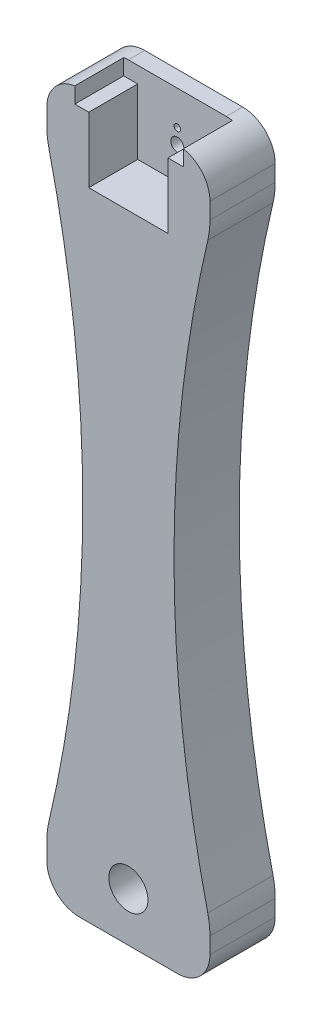
ISO-10303-21;
HEADER;
FILE_DESCRIPTION(('STEP AP214'),'2;1');
FILE_NAME('part.step','',(''),(''),'','','');
FILE_SCHEMA(('AUTOMOTIVE_DESIGN { 1 0 10303 214 1 1 1 1 }'));
ENDSEC;
DATA;
#1=APPLICATION_CONTEXT('core data for automotive mechanical design processes');
#2=APPLICATION_PROTOCOL_DEFINITION('international standard','automotive_design',2000,#1);
#3=PRODUCT_CONTEXT('',#1,'mechanical');
#4=PRODUCT('Part','Part','',(#3));
#5=PRODUCT_RELATED_PRODUCT_CATEGORY('part','',(#4));
#6=PRODUCT_DEFINITION_FORMATION('','',#4);
#7=PRODUCT_DEFINITION_CONTEXT('part definition',#1,'design');
#8=PRODUCT_DEFINITION('design','',#6,#7);
#9=PRODUCT_DEFINITION_SHAPE('','',#8);
#10=(LENGTH_UNIT() NAMED_UNIT(*) SI_UNIT(.MILLI.,.METRE.));
#11=(NAMED_UNIT(*) PLANE_ANGLE_UNIT() SI_UNIT($,.RADIAN.));
#12=(NAMED_UNIT(*) SI_UNIT($,.STERADIAN.) SOLID_ANGLE_UNIT());
#13=UNCERTAINTY_MEASURE_WITH_UNIT(LENGTH_MEASURE(1.E-05),#10,'distance_accuracy_value','');
#14=(GEOMETRIC_REPRESENTATION_CONTEXT(3) GLOBAL_UNCERTAINTY_ASSIGNED_CONTEXT((#13)) GLOBAL_UNIT_ASSIGNED_CONTEXT((#10,
#11,#12)) REPRESENTATION_CONTEXT('',''));
#15=CARTESIAN_POINT('',(0.,0.,0.));
#16=DIRECTION('',(0.,0.,1.));
#17=DIRECTION('',(1.,0.,0.));
#18=AXIS2_PLACEMENT_3D('',#15,#16,#17);
#19=CARTESIAN_POINT('',(0.,0.,20.));
#20=DIRECTION('',(0.,0.,1.));
#21=DIRECTION('',(1.,0.,0.));
#22=AXIS2_PLACEMENT_3D('',#19,#20,#21);
#23=PLANE('',#22);
#24=CARTESIAN_POINT('',(25.,-205.,20.));
#25=DIRECTION('',(0.,0.,1.));
#26=DIRECTION('',(1.,0.,0.));
#27=AXIS2_PLACEMENT_3D('',#24,#25,#26);
#28=CIRCLE('',#27,6.);
#29=CARTESIAN_POINT('',(31.,-205.,20.));
#30=VERTEX_POINT('',#29);
#31=EDGE_CURVE('E303',#30,#30,#28,.T.);
#32=ORIENTED_EDGE('',*,*,#31,.F.);
#33=EDGE_LOOP('',(#32));
#34=FACE_BOUND('',#33,.T.);
#35=CARTESIAN_POINT('',(428.980197534483,-110.,20.));
#36=DIRECTION('',(0.,0.,1.));
#37=DIRECTION('',(1.,0.,0.));
#38=AXIS2_PLACEMENT_3D('',#35,#36,#37);
#39=CIRCLE('',#38,390.);
#40=CARTESIAN_POINT('',(49.3361564779809,-20.7228915662651,20.));
#41=VERTEX_POINT('',#40);
#42=CARTESIAN_POINT('',(49.3361564779809,-199.277108433735,20.));
#43=VERTEX_POINT('',#42);
#44=EDGE_CURVE('E199',#41,#43,#39,.T.);
#45=ORIENTED_EDGE('',*,*,#44,.F.);
#46=CARTESIAN_POINT('',(25.,-15.,20.));
#47=DIRECTION('',(0.,0.,1.));
#48=DIRECTION('',(1.,0.,0.));
#49=AXIS2_PLACEMENT_3D('',#46,#47,#48);
#50=CIRCLE('',#49,25.);
#51=CARTESIAN_POINT('',(50.,-15.,20.));
#52=VERTEX_POINT('',#51);
#53=EDGE_CURVE('E208',#41,#52,#50,.T.);
#54=ORIENTED_EDGE('',*,*,#53,.T.);
#55=DIRECTION('',(0.,1.,0.));
#56=VECTOR('',#55,1.);
#57=CARTESIAN_POINT('',(50.,0.,20.));
#58=LINE('',#57,#56);
#59=CARTESIAN_POINT('',(50.,-10.,20.));
#60=VERTEX_POINT('',#59);
#61=EDGE_CURVE('E314',#52,#60,#58,.T.);
#62=ORIENTED_EDGE('',*,*,#61,.T.);
#63=CARTESIAN_POINT('',(40.,-10.,20.));
#64=DIRECTION('',(0.,0.,1.));
#65=DIRECTION('',(1.,0.,0.));
#66=AXIS2_PLACEMENT_3D('',#63,#64,#65);
#67=CIRCLE('',#66,10.);
#68=CARTESIAN_POINT('',(41.8579774574081,-0.174119898565656,20.));
#69=VERTEX_POINT('',#68);
#70=EDGE_CURVE('E361',#60,#69,#67,.T.);
#71=ORIENTED_EDGE('',*,*,#70,.T.);
#72=DIRECTION('',(0.,1.,0.));
#73=VECTOR('',#72,1.);
#74=CARTESIAN_POINT('',(41.8579774574081,0.,20.));
#75=LINE('',#74,#73);
#76=CARTESIAN_POINT('',(41.8579774574081,-4.95640450851839,20.));
#77=VERTEX_POINT('',#76);
#78=EDGE_CURVE('E246',#77,#69,#75,.T.);
#79=ORIENTED_EDGE('',*,*,#78,.F.);
#80=DIRECTION('',(1.,0.,0.));
#81=VECTOR('',#80,1.);
#82=CARTESIAN_POINT('',(0.,-4.95640450851839,20.));
#83=LINE('',#82,#81);
#84=CARTESIAN_POINT('',(37.14,-4.95640450851839,20.));
#85=VERTEX_POINT('',#84);
#86=EDGE_CURVE('E255',#85,#77,#83,.T.);
#87=ORIENTED_EDGE('',*,*,#86,.F.);
#88=DIRECTION('',(0.,1.,0.));
#89=VECTOR('',#88,1.);
#90=CARTESIAN_POINT('',(37.14,0.,20.));
#91=LINE('',#90,#89);
#92=CARTESIAN_POINT('',(37.14,-25.,20.));
#93=VERTEX_POINT('',#92);
#94=EDGE_CURVE('E290',#93,#85,#91,.T.);
#95=ORIENTED_EDGE('',*,*,#94,.F.);
#96=DIRECTION('',(1.,0.,0.));
#97=VECTOR('',#96,1.);
#98=CARTESIAN_POINT('',(25.,-25.,20.));
#99=LINE('',#98,#97);
#100=CARTESIAN_POINT('',(12.86,-25.,20.));
#101=VERTEX_POINT('',#100);
#102=EDGE_CURVE('E283',#101,#93,#99,.T.);
#103=ORIENTED_EDGE('',*,*,#102,.F.);
#104=DIRECTION('',(0.,-1.,0.));
#105=VECTOR('',#104,1.);
#106=CARTESIAN_POINT('',(12.86,-25.,20.));
#107=LINE('',#106,#105);
#108=CARTESIAN_POINT('',(12.86,-4.95640450851839,20.));
#109=VERTEX_POINT('',#108);
#110=EDGE_CURVE('E293',#109,#101,#107,.T.);
#111=ORIENTED_EDGE('',*,*,#110,.F.);
#112=CARTESIAN_POINT('',(8.5779774574081,-4.95640450851839,20.));
#113=VERTEX_POINT('',#112);
#114=EDGE_CURVE('E256',#113,#109,#83,.T.);
#115=ORIENTED_EDGE('',*,*,#114,.F.);
#116=DIRECTION('',(0.,1.,0.));
#117=VECTOR('',#116,1.);
#118=CARTESIAN_POINT('',(8.5779774574081,0.,20.));
#119=LINE('',#118,#117);
#120=CARTESIAN_POINT('',(8.5779774574081,-0.101623775165925,20.));
#121=VERTEX_POINT('',#120);
#122=EDGE_CURVE('E221',#113,#121,#119,.T.);
#123=ORIENTED_EDGE('',*,*,#122,.T.);
#124=CARTESIAN_POINT('',(10.,-10.,20.));
#125=DIRECTION('',(0.,0.,1.));
#126=DIRECTION('',(1.,0.,0.));
#127=AXIS2_PLACEMENT_3D('',#124,#125,#126);
#128=CIRCLE('',#127,10.);
#129=CARTESIAN_POINT('',(0.,-10.,20.));
#130=VERTEX_POINT('',#129);
#131=EDGE_CURVE('E364',#121,#130,#128,.T.);
#132=ORIENTED_EDGE('',*,*,#131,.T.);
#133=DIRECTION('',(0.,-1.,0.));
#134=VECTOR('',#133,1.);
#135=CARTESIAN_POINT('',(0.,0.,20.));
#136=LINE('',#135,#134);
#137=CARTESIAN_POINT('',(0.,-14.9999999999815,20.));
#138=VERTEX_POINT('',#137);
#139=EDGE_CURVE('E307',#130,#138,#136,.T.);
#140=ORIENTED_EDGE('',*,*,#139,.T.);
#141=CARTESIAN_POINT('',(25.,-15.,20.));
#142=DIRECTION('',(0.,0.,1.));
#143=DIRECTION('',(1.,0.,0.));
#144=AXIS2_PLACEMENT_3D('',#141,#142,#143);
#145=CIRCLE('',#144,25.);
#146=CARTESIAN_POINT('',(0.663843522019123,-20.722891566265,20.));
#147=VERTEX_POINT('',#146);
#148=EDGE_CURVE('E226',#138,#147,#145,.T.);
#149=ORIENTED_EDGE('',*,*,#148,.T.);
#150=CARTESIAN_POINT('',(-378.980197534483,-110.,20.));
#151=DIRECTION('',(0.,0.,1.));
#152=DIRECTION('',(1.,0.,0.));
#153=AXIS2_PLACEMENT_3D('',#150,#151,#152);
#154=CIRCLE('',#153,390.);
#155=CARTESIAN_POINT('',(0.66384352201912,-199.277108433735,20.));
#156=VERTEX_POINT('',#155);
#157=EDGE_CURVE('E232',#156,#147,#154,.T.);
#158=ORIENTED_EDGE('',*,*,#157,.F.);
#159=CARTESIAN_POINT('',(25.,-205.,20.));
#160=DIRECTION('',(0.,0.,1.));
#161=DIRECTION('',(1.,0.,0.));
#162=AXIS2_PLACEMENT_3D('',#159,#160,#161);
#163=CIRCLE('',#162,25.);
#164=CARTESIAN_POINT('',(0.,-205.,20.));
#165=VERTEX_POINT('',#164);
#166=EDGE_CURVE('E229',#156,#165,#163,.T.);
#167=ORIENTED_EDGE('',*,*,#166,.T.);
#168=CARTESIAN_POINT('',(0.,-210.,20.));
#169=VERTEX_POINT('',#168);
#170=EDGE_CURVE('E311',#165,#169,#136,.T.);
#171=ORIENTED_EDGE('',*,*,#170,.T.);
#172=CARTESIAN_POINT('',(10.,-210.,20.));
#173=DIRECTION('',(0.,0.,1.));
#174=DIRECTION('',(1.,0.,0.));
#175=AXIS2_PLACEMENT_3D('',#172,#173,#174);
#176=CIRCLE('',#175,10.);
#177=CARTESIAN_POINT('',(10.,-220.,20.));
#178=VERTEX_POINT('',#177);
#179=EDGE_CURVE('E357',#169,#178,#176,.T.);
#180=ORIENTED_EDGE('',*,*,#179,.T.);
#181=DIRECTION('',(1.,0.,0.));
#182=VECTOR('',#181,1.);
#183=CARTESIAN_POINT('',(0.,-220.,20.));
#184=LINE('',#183,#182);
#185=CARTESIAN_POINT('',(40.,-220.,20.));
#186=VERTEX_POINT('',#185);
#187=EDGE_CURVE('E310',#178,#186,#184,.T.);
#188=ORIENTED_EDGE('',*,*,#187,.T.);
#189=CARTESIAN_POINT('',(40.,-210.,20.));
#190=DIRECTION('',(0.,0.,1.));
#191=DIRECTION('',(1.,0.,0.));
#192=AXIS2_PLACEMENT_3D('',#189,#190,#191);
#193=CIRCLE('',#192,10.);
#194=CARTESIAN_POINT('',(50.,-210.,20.));
#195=VERTEX_POINT('',#194);
#196=EDGE_CURVE('E359',#186,#195,#193,.T.);
#197=ORIENTED_EDGE('',*,*,#196,.T.);
#198=CARTESIAN_POINT('',(50.,-205.,20.));
#199=VERTEX_POINT('',#198);
#200=EDGE_CURVE('E315',#195,#199,#58,.T.);
#201=ORIENTED_EDGE('',*,*,#200,.T.);
#202=CARTESIAN_POINT('',(25.,-205.,20.));
#203=DIRECTION('',(0.,0.,1.));
#204=DIRECTION('',(1.,0.,0.));
#205=AXIS2_PLACEMENT_3D('',#202,#203,#204);
#206=CIRCLE('',#205,25.);
#207=EDGE_CURVE('E205',#199,#43,#206,.T.);
#208=ORIENTED_EDGE('',*,*,#207,.T.);
#209=EDGE_LOOP('',(#45,#54,#62,#71,#79,#87,#95,#103,#111,#115,#123,#132,#140,#149,#158,#167,
#171,#180,#188,#197,#201,#208));
#210=FACE_BOUND('',#209,.T.);
#211=ADVANCED_FACE('F37',(#34,#210),#23,.T.);
#212=CARTESIAN_POINT('',(0.,0.,20.));
#213=DIRECTION('',(1.,0.,0.));
#214=DIRECTION('',(0.,1.,0.));
#215=AXIS2_PLACEMENT_3D('',#212,#213,#214);
#216=PLANE('',#215);
#217=DIRECTION('',(0.,0.,1.));
#218=VECTOR('',#217,1.);
#219=CARTESIAN_POINT('',(0.,-205.,-33.));
#220=LINE('',#219,#218);
#221=CARTESIAN_POINT('',(0.,-205.,0.));
#222=VERTEX_POINT('',#221);
#223=EDGE_CURVE('E238',#222,#165,#220,.T.);
#224=ORIENTED_EDGE('',*,*,#223,.F.);
#225=DIRECTION('',(0.,-1.,0.));
#226=VECTOR('',#225,1.);
#227=CARTESIAN_POINT('',(0.,0.,0.));
#228=LINE('',#227,#226);
#229=CARTESIAN_POINT('',(0.,-210.,0.));
#230=VERTEX_POINT('',#229);
#231=EDGE_CURVE('E322',#222,#230,#228,.T.);
#232=ORIENTED_EDGE('',*,*,#231,.T.);
#233=DIRECTION('',(0.,0.,-1.));
#234=VECTOR('',#233,1.);
#235=CARTESIAN_POINT('',(0.,-210.,20.));
#236=LINE('',#235,#234);
#237=EDGE_CURVE('E317',#230,#169,#236,.F.);
#238=ORIENTED_EDGE('',*,*,#237,.T.);
#239=ORIENTED_EDGE('',*,*,#170,.F.);
#240=EDGE_LOOP('',(#224,#232,#238,#239));
#241=FACE_BOUND('',#240,.T.);
#242=ADVANCED_FACE('F470',(#241),#216,.F.);
#243=CARTESIAN_POINT('',(50.,0.,20.));
#244=DIRECTION('',(-1.,0.,0.));
#245=DIRECTION('',(0.,-1.,0.));
#246=AXIS2_PLACEMENT_3D('',#243,#244,#245);
#247=PLANE('',#246);
#248=DIRECTION('',(0.,0.,1.));
#249=VECTOR('',#248,1.);
#250=CARTESIAN_POINT('',(50.,-15.,-33.));
#251=LINE('',#250,#249);
#252=CARTESIAN_POINT('',(50.,-15.,0.));
#253=VERTEX_POINT('',#252);
#254=EDGE_CURVE('E211',#253,#52,#251,.T.);
#255=ORIENTED_EDGE('',*,*,#254,.F.);
#256=DIRECTION('',(0.,1.,0.));
#257=VECTOR('',#256,1.);
#258=CARTESIAN_POINT('',(50.,0.,0.));
#259=LINE('',#258,#257);
#260=CARTESIAN_POINT('',(50.,-10.,0.));
#261=VERTEX_POINT('',#260);
#262=EDGE_CURVE('E325',#253,#261,#259,.T.);
#263=ORIENTED_EDGE('',*,*,#262,.T.);
#264=DIRECTION('',(0.,0.,-1.));
#265=VECTOR('',#264,1.);
#266=CARTESIAN_POINT('',(50.,-10.,20.));
#267=LINE('',#266,#265);
#268=EDGE_CURVE('E369',#261,#60,#267,.F.);
#269=ORIENTED_EDGE('',*,*,#268,.T.);
#270=ORIENTED_EDGE('',*,*,#61,.F.);
#271=EDGE_LOOP('',(#255,#263,#269,#270));
#272=FACE_BOUND('',#271,.T.);
#273=ADVANCED_FACE('F406',(#272),#247,.F.);
#274=CARTESIAN_POINT('',(0.,0.,0.));
#275=DIRECTION('',(0.,0.,1.));
#276=DIRECTION('',(1.,0.,0.));
#277=AXIS2_PLACEMENT_3D('',#274,#275,#276);
#278=PLANE('',#277);
#279=CARTESIAN_POINT('',(25.,-10.5,0.));
#280=DIRECTION('',(0.,0.,-1.));
#281=DIRECTION('',(-1.,0.,0.));
#282=AXIS2_PLACEMENT_3D('',#279,#280,#281);
#283=CIRCLE('',#282,1.);
#284=CARTESIAN_POINT('',(24.,-10.5,0.));
#285=VERTEX_POINT('',#284);
#286=EDGE_CURVE('E273',#285,#285,#283,.T.);
#287=ORIENTED_EDGE('',*,*,#286,.F.);
#288=EDGE_LOOP('',(#287));
#289=FACE_BOUND('',#288,.T.);
#290=CARTESIAN_POINT('',(25.,-19.5,0.));
#291=DIRECTION('',(0.,0.,-1.));
#292=DIRECTION('',(-1.,0.,0.));
#293=AXIS2_PLACEMENT_3D('',#290,#291,#292);
#294=CIRCLE('',#293,1.);
#295=CARTESIAN_POINT('',(24.,-19.5,0.));
#296=VERTEX_POINT('',#295);
#297=EDGE_CURVE('E272',#296,#296,#294,.T.);
#298=ORIENTED_EDGE('',*,*,#297,.F.);
#299=EDGE_LOOP('',(#298));
#300=FACE_BOUND('',#299,.T.);
#301=CARTESIAN_POINT('',(25.,-205.,0.));
#302=DIRECTION('',(0.,0.,1.));
#303=DIRECTION('',(1.,0.,0.));
#304=AXIS2_PLACEMENT_3D('',#301,#302,#303);
#305=CIRCLE('',#304,6.);
#306=CARTESIAN_POINT('',(31.,-205.,0.));
#307=VERTEX_POINT('',#306);
#308=EDGE_CURVE('E334',#307,#307,#305,.T.);
#309=ORIENTED_EDGE('',*,*,#308,.T.);
#310=EDGE_LOOP('',(#309));
#311=FACE_BOUND('',#310,.T.);
#312=CARTESIAN_POINT('',(25.,-15.,0.));
#313=DIRECTION('',(0.,0.,1.));
#314=DIRECTION('',(1.,0.,0.));
#315=AXIS2_PLACEMENT_3D('',#312,#313,#314);
#316=CIRCLE('',#315,2.);
#317=CARTESIAN_POINT('',(27.,-15.,0.));
#318=VERTEX_POINT('',#317);
#319=EDGE_CURVE('E306',#318,#318,#316,.T.);
#320=ORIENTED_EDGE('',*,*,#319,.T.);
#321=EDGE_LOOP('',(#320));
#322=FACE_BOUND('',#321,.T.);
#323=CARTESIAN_POINT('',(25.,-15.,0.));
#324=DIRECTION('',(0.,0.,1.));
#325=DIRECTION('',(1.,0.,0.));
#326=AXIS2_PLACEMENT_3D('',#323,#324,#325);
#327=CIRCLE('',#326,25.);
#328=CARTESIAN_POINT('',(49.3361564779809,-20.7228915662651,0.));
#329=VERTEX_POINT('',#328);
#330=EDGE_CURVE('E11',#329,#253,#327,.T.);
#331=ORIENTED_EDGE('',*,*,#330,.F.);
#332=CARTESIAN_POINT('',(428.980197534483,-110.,0.));
#333=DIRECTION('',(0.,0.,1.));
#334=DIRECTION('',(1.,0.,0.));
#335=AXIS2_PLACEMENT_3D('',#332,#333,#334);
#336=CIRCLE('',#335,390.);
#337=CARTESIAN_POINT('',(49.3361564779809,-199.277108433735,0.));
#338=VERTEX_POINT('',#337);
#339=EDGE_CURVE('E202',#329,#338,#336,.T.);
#340=ORIENTED_EDGE('',*,*,#339,.T.);
#341=CARTESIAN_POINT('',(25.,-205.,0.));
#342=DIRECTION('',(0.,0.,1.));
#343=DIRECTION('',(1.,0.,0.));
#344=AXIS2_PLACEMENT_3D('',#341,#342,#343);
#345=CIRCLE('',#344,25.);
#346=CARTESIAN_POINT('',(50.,-205.,0.));
#347=VERTEX_POINT('',#346);
#348=EDGE_CURVE('E45',#347,#338,#345,.T.);
#349=ORIENTED_EDGE('',*,*,#348,.F.);
#350=CARTESIAN_POINT('',(50.,-210.,0.));
#351=VERTEX_POINT('',#350);
#352=EDGE_CURVE('E326',#351,#347,#259,.T.);
#353=ORIENTED_EDGE('',*,*,#352,.F.);
#354=CARTESIAN_POINT('',(40.,-210.,0.));
#355=DIRECTION('',(0.,0.,1.));
#356=DIRECTION('',(1.,0.,0.));
#357=AXIS2_PLACEMENT_3D('',#354,#355,#356);
#358=CIRCLE('',#357,10.);
#359=CARTESIAN_POINT('',(40.,-220.,0.));
#360=VERTEX_POINT('',#359);
#361=EDGE_CURVE('E345',#351,#360,#358,.F.);
#362=ORIENTED_EDGE('',*,*,#361,.T.);
#363=DIRECTION('',(1.,0.,0.));
#364=VECTOR('',#363,1.);
#365=CARTESIAN_POINT('',(0.,-220.,0.));
#366=LINE('',#365,#364);
#367=CARTESIAN_POINT('',(10.,-220.,0.));
#368=VERTEX_POINT('',#367);
#369=EDGE_CURVE('E321',#368,#360,#366,.T.);
#370=ORIENTED_EDGE('',*,*,#369,.F.);
#371=CARTESIAN_POINT('',(10.,-210.,0.));
#372=DIRECTION('',(0.,0.,1.));
#373=DIRECTION('',(1.,0.,0.));
#374=AXIS2_PLACEMENT_3D('',#371,#372,#373);
#375=CIRCLE('',#374,10.);
#376=EDGE_CURVE('E342',#368,#230,#375,.F.);
#377=ORIENTED_EDGE('',*,*,#376,.T.);
#378=ORIENTED_EDGE('',*,*,#231,.F.);
#379=CARTESIAN_POINT('',(25.,-205.,0.));
#380=DIRECTION('',(0.,0.,1.));
#381=DIRECTION('',(1.,0.,0.));
#382=AXIS2_PLACEMENT_3D('',#379,#380,#381);
#383=CIRCLE('',#382,25.);
#384=CARTESIAN_POINT('',(0.66384352201912,-199.277108433735,0.));
#385=VERTEX_POINT('',#384);
#386=EDGE_CURVE('E391',#385,#222,#383,.T.);
#387=ORIENTED_EDGE('',*,*,#386,.F.);
#388=CARTESIAN_POINT('',(-378.980197534483,-110.,0.));
#389=DIRECTION('',(0.,0.,1.));
#390=DIRECTION('',(1.,0.,0.));
#391=AXIS2_PLACEMENT_3D('',#388,#389,#390);
#392=CIRCLE('',#391,390.);
#393=CARTESIAN_POINT('',(0.663843522019123,-20.722891566265,0.));
#394=VERTEX_POINT('',#393);
#395=EDGE_CURVE('E393',#385,#394,#392,.T.);
#396=ORIENTED_EDGE('',*,*,#395,.T.);
#397=CARTESIAN_POINT('',(25.,-15.,0.));
#398=DIRECTION('',(0.,0.,1.));
#399=DIRECTION('',(1.,0.,0.));
#400=AXIS2_PLACEMENT_3D('',#397,#398,#399);
#401=CIRCLE('',#400,25.);
#402=CARTESIAN_POINT('',(0.,-14.9999999999815,0.));
#403=VERTEX_POINT('',#402);
#404=EDGE_CURVE('E396',#403,#394,#401,.T.);
#405=ORIENTED_EDGE('',*,*,#404,.F.);
#406=CARTESIAN_POINT('',(0.,-10.,0.));
#407=VERTEX_POINT('',#406);
#408=EDGE_CURVE('E318',#407,#403,#228,.T.);
#409=ORIENTED_EDGE('',*,*,#408,.F.);
#410=CARTESIAN_POINT('',(10.,-10.,0.));
#411=DIRECTION('',(0.,0.,1.));
#412=DIRECTION('',(1.,0.,0.));
#413=AXIS2_PLACEMENT_3D('',#410,#411,#412);
#414=CIRCLE('',#413,10.);
#415=CARTESIAN_POINT('',(10.,0.,0.));
#416=VERTEX_POINT('',#415);
#417=EDGE_CURVE('E350',#407,#416,#414,.F.);
#418=ORIENTED_EDGE('',*,*,#417,.T.);
#419=DIRECTION('',(-1.,0.,0.));
#420=VECTOR('',#419,1.);
#421=CARTESIAN_POINT('',(0.,0.,0.));
#422=LINE('',#421,#420);
#423=CARTESIAN_POINT('',(40.,0.,0.));
#424=VERTEX_POINT('',#423);
#425=EDGE_CURVE('E329',#424,#416,#422,.T.);
#426=ORIENTED_EDGE('',*,*,#425,.F.);
#427=CARTESIAN_POINT('',(40.,-10.,0.));
#428=DIRECTION('',(0.,0.,1.));
#429=DIRECTION('',(1.,0.,0.));
#430=AXIS2_PLACEMENT_3D('',#427,#428,#429);
#431=CIRCLE('',#430,10.);
#432=EDGE_CURVE('E347',#424,#261,#431,.F.);
#433=ORIENTED_EDGE('',*,*,#432,.T.);
#434=ORIENTED_EDGE('',*,*,#262,.F.);
#435=EDGE_LOOP('',(#331,#340,#349,#353,#362,#370,#377,#378,#387,#396,#405,#409,#418,#426,#433,#434));
#436=FACE_BOUND('',#435,.T.);
#437=ADVANCED_FACE('F403',(#289,#300,#311,#322,#436),#278,.F.);
#438=CARTESIAN_POINT('',(0.,0.,20.));
#439=DIRECTION('',(0.,-1.,0.));
#440=DIRECTION('',(0.,0.,-1.));
#441=AXIS2_PLACEMENT_3D('',#438,#439,#440);
#442=PLANE('',#441);
#443=DIRECTION('',(-1.,0.,0.));
#444=VECTOR('',#443,1.);
#445=CARTESIAN_POINT('',(12.86,0.,5.));
#446=LINE('',#445,#444);
#447=CARTESIAN_POINT('',(40.,0.,5.));
#448=VERTEX_POINT('',#447);
#449=CARTESIAN_POINT('',(10.,0.,5.));
#450=VERTEX_POINT('',#449);
#451=EDGE_CURVE('E282',#448,#450,#446,.T.);
#452=ORIENTED_EDGE('',*,*,#451,.F.);
#453=DIRECTION('',(0.,0.,-1.));
#454=VECTOR('',#453,1.);
#455=CARTESIAN_POINT('',(40.,0.,20.));
#456=LINE('',#455,#454);
#457=EDGE_CURVE('E352',#448,#424,#456,.T.);
#458=ORIENTED_EDGE('',*,*,#457,.T.);
#459=ORIENTED_EDGE('',*,*,#425,.T.);
#460=DIRECTION('',(0.,0.,-1.));
#461=VECTOR('',#460,1.);
#462=CARTESIAN_POINT('',(10.,0.,20.));
#463=LINE('',#462,#461);
#464=EDGE_CURVE('E354',#416,#450,#463,.F.);
#465=ORIENTED_EDGE('',*,*,#464,.T.);
#466=EDGE_LOOP('',(#452,#458,#459,#465));
#467=FACE_BOUND('',#466,.T.);
#468=ADVANCED_FACE('F513',(#467),#442,.F.);
#469=CARTESIAN_POINT('',(10.,-10.,20.));
#470=DIRECTION('',(0.,0.,-1.));
#471=DIRECTION('',(-1.,0.,0.));
#472=AXIS2_PLACEMENT_3D('',#469,#470,#471);
#473=CYLINDRICAL_SURFACE('',#472,10.);
#474=ORIENTED_EDGE('',*,*,#131,.F.);
#475=DIRECTION('',(0.,0.,-1.));
#476=VECTOR('',#475,1.);
#477=CARTESIAN_POINT('',(8.5779774574081,-0.101623775165925,20.));
#478=LINE('',#477,#476);
#479=CARTESIAN_POINT('',(8.5779774574081,-0.101623775165925,5.));
#480=VERTEX_POINT('',#479);
#481=EDGE_CURVE('E388',#121,#480,#478,.T.);
#482=ORIENTED_EDGE('',*,*,#481,.T.);
#483=CARTESIAN_POINT('',(10.,-10.,5.));
#484=DIRECTION('',(0.,0.,1.));
#485=DIRECTION('',(1.,0.,0.));
#486=AXIS2_PLACEMENT_3D('',#483,#484,#485);
#487=CIRCLE('',#486,10.);
#488=EDGE_CURVE('E262',#480,#450,#487,.F.);
#489=ORIENTED_EDGE('',*,*,#488,.T.);
#490=ORIENTED_EDGE('',*,*,#464,.F.);
#491=ORIENTED_EDGE('',*,*,#417,.F.);
#492=DIRECTION('',(0.,0.,-1.));
#493=VECTOR('',#492,1.);
#494=CARTESIAN_POINT('',(0.,-10.,20.));
#495=LINE('',#494,#493);
#496=EDGE_CURVE('E339',#130,#407,#495,.T.);
#497=ORIENTED_EDGE('',*,*,#496,.F.);
#498=EDGE_LOOP('',(#474,#482,#489,#490,#491,#497));
#499=FACE_BOUND('',#498,.T.);
#500=ADVANCED_FACE('F453',(#499),#473,.T.);
#501=CARTESIAN_POINT('',(25.,-15.,-14.));
#502=DIRECTION('',(0.,0.,1.));
#503=DIRECTION('',(1.,0.,0.));
#504=AXIS2_PLACEMENT_3D('',#501,#502,#503);
#505=CYLINDRICAL_SURFACE('',#504,2.);
#506=ORIENTED_EDGE('',*,*,#319,.F.);
#507=EDGE_LOOP('',(#506));
#508=FACE_BOUND('',#507,.T.);
#509=CARTESIAN_POINT('',(25.,-15.,5.));
#510=DIRECTION('',(0.,0.,1.));
#511=DIRECTION('',(1.,0.,0.));
#512=AXIS2_PLACEMENT_3D('',#509,#510,#511);
#513=CIRCLE('',#512,2.);
#514=CARTESIAN_POINT('',(27.,-15.,5.));
#515=VERTEX_POINT('',#514);
#516=EDGE_CURVE('E300',#515,#515,#513,.F.);
#517=ORIENTED_EDGE('',*,*,#516,.F.);
#518=EDGE_LOOP('',(#517));
#519=FACE_BOUND('',#518,.T.);
#520=ADVANCED_FACE('F509',(#508,#519),#505,.F.);
#521=ORIENTED_EDGE('',*,*,#408,.T.);
#522=DIRECTION('',(0.,0.,1.));
#523=VECTOR('',#522,1.);
#524=CARTESIAN_POINT('',(0.,-14.9999999999815,-33.));
#525=LINE('',#524,#523);
#526=EDGE_CURVE('E235',#403,#138,#525,.T.);
#527=ORIENTED_EDGE('',*,*,#526,.T.);
#528=ORIENTED_EDGE('',*,*,#139,.F.);
#529=ORIENTED_EDGE('',*,*,#496,.T.);
#530=EDGE_LOOP('',(#521,#527,#528,#529));
#531=FACE_BOUND('',#530,.T.);
#532=ADVANCED_FACE('F457',(#531),#216,.F.);
#533=CARTESIAN_POINT('',(0.,-220.,20.));
#534=DIRECTION('',(0.,1.,0.));
#535=DIRECTION('',(0.,0.,1.));
#536=AXIS2_PLACEMENT_3D('',#533,#534,#535);
#537=PLANE('',#536);
#538=ORIENTED_EDGE('',*,*,#369,.T.);
#539=DIRECTION('',(0.,0.,-1.));
#540=VECTOR('',#539,1.);
#541=CARTESIAN_POINT('',(40.,-220.,20.));
#542=LINE('',#541,#540);
#543=EDGE_CURVE('E375',#360,#186,#542,.F.);
#544=ORIENTED_EDGE('',*,*,#543,.T.);
#545=ORIENTED_EDGE('',*,*,#187,.F.);
#546=DIRECTION('',(0.,0.,-1.));
#547=VECTOR('',#546,1.);
#548=CARTESIAN_POINT('',(10.,-220.,20.));
#549=LINE('',#548,#547);
#550=EDGE_CURVE('E372',#178,#368,#549,.T.);
#551=ORIENTED_EDGE('',*,*,#550,.T.);
#552=EDGE_LOOP('',(#538,#544,#545,#551));
#553=FACE_BOUND('',#552,.T.);
#554=ADVANCED_FACE('F479',(#553),#537,.F.);
#555=ORIENTED_EDGE('',*,*,#352,.T.);
#556=DIRECTION('',(0.,0.,1.));
#557=VECTOR('',#556,1.);
#558=CARTESIAN_POINT('',(50.,-205.,-33.));
#559=LINE('',#558,#557);
#560=EDGE_CURVE('E222',#347,#199,#559,.T.);
#561=ORIENTED_EDGE('',*,*,#560,.T.);
#562=ORIENTED_EDGE('',*,*,#200,.F.);
#563=DIRECTION('',(0.,0.,-1.));
#564=VECTOR('',#563,1.);
#565=CARTESIAN_POINT('',(50.,-210.,20.));
#566=LINE('',#565,#564);
#567=EDGE_CURVE('E366',#195,#351,#566,.T.);
#568=ORIENTED_EDGE('',*,*,#567,.T.);
#569=EDGE_LOOP('',(#555,#561,#562,#568));
#570=FACE_BOUND('',#569,.T.);
#571=ADVANCED_FACE('F487',(#570),#247,.F.);
#572=CARTESIAN_POINT('',(25.,-205.,-14.));
#573=DIRECTION('',(0.,0.,1.));
#574=DIRECTION('',(1.,0.,0.));
#575=AXIS2_PLACEMENT_3D('',#572,#573,#574);
#576=CYLINDRICAL_SURFACE('',#575,6.);
#577=ORIENTED_EDGE('',*,*,#31,.T.);
#578=EDGE_LOOP('',(#577));
#579=FACE_BOUND('',#578,.T.);
#580=ORIENTED_EDGE('',*,*,#308,.F.);
#581=EDGE_LOOP('',(#580));
#582=FACE_BOUND('',#581,.T.);
#583=ADVANCED_FACE('F520',(#579,#582),#576,.F.);
#584=CARTESIAN_POINT('',(40.,-10.,20.));
#585=DIRECTION('',(0.,0.,-1.));
#586=DIRECTION('',(-1.,0.,0.));
#587=AXIS2_PLACEMENT_3D('',#584,#585,#586);
#588=CYLINDRICAL_SURFACE('',#587,10.);
#589=DIRECTION('',(0.,0.,-1.));
#590=VECTOR('',#589,1.);
#591=CARTESIAN_POINT('',(41.8579774574081,-0.174119898565656,20.));
#592=LINE('',#591,#590);
#593=CARTESIAN_POINT('',(41.8579774574081,-0.174119898565656,5.));
#594=VERTEX_POINT('',#593);
#595=EDGE_CURVE('E386',#69,#594,#592,.T.);
#596=ORIENTED_EDGE('',*,*,#595,.F.);
#597=ORIENTED_EDGE('',*,*,#70,.F.);
#598=ORIENTED_EDGE('',*,*,#268,.F.);
#599=ORIENTED_EDGE('',*,*,#432,.F.);
#600=ORIENTED_EDGE('',*,*,#457,.F.);
#601=CARTESIAN_POINT('',(40.,-10.,5.));
#602=DIRECTION('',(0.,0.,1.));
#603=DIRECTION('',(1.,0.,0.));
#604=AXIS2_PLACEMENT_3D('',#601,#602,#603);
#605=CIRCLE('',#604,10.);
#606=EDGE_CURVE('E266',#448,#594,#605,.F.);
#607=ORIENTED_EDGE('',*,*,#606,.T.);
#608=EDGE_LOOP('',(#596,#597,#598,#599,#600,#607));
#609=FACE_BOUND('',#608,.T.);
#610=ADVANCED_FACE('F413',(#609),#588,.T.);
#611=CARTESIAN_POINT('',(40.,-210.,20.));
#612=DIRECTION('',(0.,0.,-1.));
#613=DIRECTION('',(-1.,0.,0.));
#614=AXIS2_PLACEMENT_3D('',#611,#612,#613);
#615=CYLINDRICAL_SURFACE('',#614,10.);
#616=ORIENTED_EDGE('',*,*,#196,.F.);
#617=ORIENTED_EDGE('',*,*,#543,.F.);
#618=ORIENTED_EDGE('',*,*,#361,.F.);
#619=ORIENTED_EDGE('',*,*,#567,.F.);
#620=EDGE_LOOP('',(#616,#617,#618,#619));
#621=FACE_BOUND('',#620,.T.);
#622=ADVANCED_FACE('F483',(#621),#615,.T.);
#623=CARTESIAN_POINT('',(10.,-210.,20.));
#624=DIRECTION('',(0.,0.,-1.));
#625=DIRECTION('',(-1.,0.,0.));
#626=AXIS2_PLACEMENT_3D('',#623,#624,#625);
#627=CYLINDRICAL_SURFACE('',#626,10.);
#628=ORIENTED_EDGE('',*,*,#179,.F.);
#629=ORIENTED_EDGE('',*,*,#237,.F.);
#630=ORIENTED_EDGE('',*,*,#376,.F.);
#631=ORIENTED_EDGE('',*,*,#550,.F.);
#632=EDGE_LOOP('',(#628,#629,#630,#631));
#633=FACE_BOUND('',#632,.T.);
#634=ADVANCED_FACE('F39',(#633),#627,.T.);
#635=CARTESIAN_POINT('',(0.,0.,5.));
#636=DIRECTION('',(0.,0.,1.));
#637=DIRECTION('',(1.,0.,0.));
#638=AXIS2_PLACEMENT_3D('',#635,#636,#637);
#639=PLANE('',#638);
#640=DIRECTION('',(0.,1.,0.));
#641=VECTOR('',#640,1.);
#642=CARTESIAN_POINT('',(37.14,0.,5.));
#643=LINE('',#642,#641);
#644=CARTESIAN_POINT('',(37.14,-25.,5.));
#645=VERTEX_POINT('',#644);
#646=CARTESIAN_POINT('',(37.14,-4.95640450851839,5.));
#647=VERTEX_POINT('',#646);
#648=EDGE_CURVE('E279',#645,#647,#643,.T.);
#649=ORIENTED_EDGE('',*,*,#648,.T.);
#650=DIRECTION('',(1.,0.,0.));
#651=VECTOR('',#650,1.);
#652=CARTESIAN_POINT('',(0.,-4.95640450851839,5.));
#653=LINE('',#652,#651);
#654=CARTESIAN_POINT('',(41.8579774574081,-4.95640450851839,5.));
#655=VERTEX_POINT('',#654);
#656=EDGE_CURVE('E245',#647,#655,#653,.T.);
#657=ORIENTED_EDGE('',*,*,#656,.T.);
#658=DIRECTION('',(0.,1.,0.));
#659=VECTOR('',#658,1.);
#660=CARTESIAN_POINT('',(41.8579774574081,0.,5.));
#661=LINE('',#660,#659);
#662=EDGE_CURVE('E249',#655,#594,#661,.T.);
#663=ORIENTED_EDGE('',*,*,#662,.T.);
#664=ORIENTED_EDGE('',*,*,#606,.F.);
#665=ORIENTED_EDGE('',*,*,#451,.T.);
#666=ORIENTED_EDGE('',*,*,#488,.F.);
#667=DIRECTION('',(0.,1.,0.));
#668=VECTOR('',#667,1.);
#669=CARTESIAN_POINT('',(8.5779774574081,0.,5.));
#670=LINE('',#669,#668);
#671=CARTESIAN_POINT('',(8.5779774574081,-4.95640450851839,5.));
#672=VERTEX_POINT('',#671);
#673=EDGE_CURVE('E242',#672,#480,#670,.T.);
#674=ORIENTED_EDGE('',*,*,#673,.F.);
#675=CARTESIAN_POINT('',(12.86,-4.95640450851839,5.));
#676=VERTEX_POINT('',#675);
#677=EDGE_CURVE('E247',#672,#676,#653,.T.);
#678=ORIENTED_EDGE('',*,*,#677,.T.);
#679=DIRECTION('',(0.,-1.,0.));
#680=VECTOR('',#679,1.);
#681=CARTESIAN_POINT('',(12.86,-25.,5.));
#682=LINE('',#681,#680);
#683=CARTESIAN_POINT('',(12.86,-25.,5.));
#684=VERTEX_POINT('',#683);
#685=EDGE_CURVE('E285',#676,#684,#682,.T.);
#686=ORIENTED_EDGE('',*,*,#685,.T.);
#687=DIRECTION('',(1.,0.,0.));
#688=VECTOR('',#687,1.);
#689=CARTESIAN_POINT('',(25.,-25.,5.));
#690=LINE('',#689,#688);
#691=EDGE_CURVE('E287',#684,#645,#690,.T.);
#692=ORIENTED_EDGE('',*,*,#691,.T.);
#693=EDGE_LOOP('',(#649,#657,#663,#664,#665,#666,#674,#678,#686,#692));
#694=FACE_BOUND('',#693,.T.);
#695=CARTESIAN_POINT('',(25.,-10.5,5.));
#696=DIRECTION('',(0.,0.,1.));
#697=DIRECTION('',(1.,0.,0.));
#698=AXIS2_PLACEMENT_3D('',#695,#696,#697);
#699=CIRCLE('',#698,1.);
#700=CARTESIAN_POINT('',(26.,-10.5,5.));
#701=VERTEX_POINT('',#700);
#702=EDGE_CURVE('E294',#701,#701,#699,.T.);
#703=ORIENTED_EDGE('',*,*,#702,.F.);
#704=EDGE_LOOP('',(#703));
#705=FACE_BOUND('',#704,.T.);
#706=CARTESIAN_POINT('',(25.,-19.5,5.));
#707=DIRECTION('',(0.,0.,1.));
#708=DIRECTION('',(1.,0.,0.));
#709=AXIS2_PLACEMENT_3D('',#706,#707,#708);
#710=CIRCLE('',#709,1.);
#711=CARTESIAN_POINT('',(26.,-19.5,5.));
#712=VERTEX_POINT('',#711);
#713=EDGE_CURVE('E276',#712,#712,#710,.T.);
#714=ORIENTED_EDGE('',*,*,#713,.F.);
#715=EDGE_LOOP('',(#714));
#716=FACE_BOUND('',#715,.T.);
#717=ORIENTED_EDGE('',*,*,#516,.T.);
#718=EDGE_LOOP('',(#717));
#719=FACE_BOUND('',#718,.T.);
#720=ADVANCED_FACE('F421',(#694,#705,#716,#719),#639,.T.);
#721=CARTESIAN_POINT('',(37.14,0.,5.));
#722=DIRECTION('',(1.,0.,0.));
#723=DIRECTION('',(0.,0.,-1.));
#724=AXIS2_PLACEMENT_3D('',#721,#722,#723);
#725=PLANE('',#724);
#726=ORIENTED_EDGE('',*,*,#94,.T.);
#727=DIRECTION('',(0.,0.,-1.));
#728=VECTOR('',#727,1.);
#729=CARTESIAN_POINT('',(37.14,-4.95640450851839,5.));
#730=LINE('',#729,#728);
#731=EDGE_CURVE('E269',#85,#647,#730,.T.);
#732=ORIENTED_EDGE('',*,*,#731,.T.);
#733=ORIENTED_EDGE('',*,*,#648,.F.);
#734=DIRECTION('',(0.,0.,1.));
#735=VECTOR('',#734,1.);
#736=CARTESIAN_POINT('',(37.14,-25.,5.));
#737=LINE('',#736,#735);
#738=EDGE_CURVE('E298',#645,#93,#737,.T.);
#739=ORIENTED_EDGE('',*,*,#738,.T.);
#740=EDGE_LOOP('',(#726,#732,#733,#739));
#741=FACE_BOUND('',#740,.T.);
#742=ADVANCED_FACE('F430',(#741),#725,.F.);
#743=CARTESIAN_POINT('',(25.,-25.,5.));
#744=DIRECTION('',(0.,-1.,0.));
#745=DIRECTION('',(0.,0.,-1.));
#746=AXIS2_PLACEMENT_3D('',#743,#744,#745);
#747=PLANE('',#746);
#748=ORIENTED_EDGE('',*,*,#102,.T.);
#749=ORIENTED_EDGE('',*,*,#738,.F.);
#750=ORIENTED_EDGE('',*,*,#691,.F.);
#751=DIRECTION('',(0.,0.,1.));
#752=VECTOR('',#751,1.);
#753=CARTESIAN_POINT('',(12.86,-25.,5.));
#754=LINE('',#753,#752);
#755=EDGE_CURVE('E289',#684,#101,#754,.T.);
#756=ORIENTED_EDGE('',*,*,#755,.T.);
#757=EDGE_LOOP('',(#748,#749,#750,#756));
#758=FACE_BOUND('',#757,.T.);
#759=ADVANCED_FACE('F434',(#758),#747,.F.);
#760=CARTESIAN_POINT('',(12.86,-25.,5.));
#761=DIRECTION('',(-1.,0.,0.));
#762=DIRECTION('',(0.,-1.,0.));
#763=AXIS2_PLACEMENT_3D('',#760,#761,#762);
#764=PLANE('',#763);
#765=ORIENTED_EDGE('',*,*,#685,.F.);
#766=DIRECTION('',(0.,0.,1.));
#767=VECTOR('',#766,1.);
#768=CARTESIAN_POINT('',(12.86,-4.95640450851839,5.));
#769=LINE('',#768,#767);
#770=EDGE_CURVE('E377',#676,#109,#769,.T.);
#771=ORIENTED_EDGE('',*,*,#770,.T.);
#772=ORIENTED_EDGE('',*,*,#110,.T.);
#773=ORIENTED_EDGE('',*,*,#755,.F.);
#774=EDGE_LOOP('',(#765,#771,#772,#773));
#775=FACE_BOUND('',#774,.T.);
#776=ADVANCED_FACE('F440',(#775),#764,.F.);
#777=CARTESIAN_POINT('',(25.,-19.5,15.));
#778=DIRECTION('',(0.,0.,-1.));
#779=DIRECTION('',(-1.,0.,0.));
#780=AXIS2_PLACEMENT_3D('',#777,#778,#779);
#781=CYLINDRICAL_SURFACE('',#780,1.);
#782=ORIENTED_EDGE('',*,*,#713,.T.);
#783=EDGE_LOOP('',(#782));
#784=FACE_BOUND('',#783,.T.);
#785=ORIENTED_EDGE('',*,*,#297,.T.);
#786=EDGE_LOOP('',(#785));
#787=FACE_BOUND('',#786,.T.);
#788=ADVANCED_FACE('F545',(#784,#787),#781,.F.);
#789=CARTESIAN_POINT('',(25.,-10.5,15.));
#790=DIRECTION('',(0.,0.,-1.));
#791=DIRECTION('',(-1.,0.,0.));
#792=AXIS2_PLACEMENT_3D('',#789,#790,#791);
#793=CYLINDRICAL_SURFACE('',#792,1.);
#794=ORIENTED_EDGE('',*,*,#702,.T.);
#795=EDGE_LOOP('',(#794));
#796=FACE_BOUND('',#795,.T.);
#797=ORIENTED_EDGE('',*,*,#286,.T.);
#798=EDGE_LOOP('',(#797));
#799=FACE_BOUND('',#798,.T.);
#800=ADVANCED_FACE('F693',(#796,#799),#793,.F.);
#801=CARTESIAN_POINT('',(0.,-4.95640450851839,5.));
#802=DIRECTION('',(0.,-1.,0.));
#803=DIRECTION('',(1.,0.,0.));
#804=AXIS2_PLACEMENT_3D('',#801,#802,#803);
#805=PLANE('',#804);
#806=ORIENTED_EDGE('',*,*,#677,.F.);
#807=DIRECTION('',(0.,0.,1.));
#808=VECTOR('',#807,1.);
#809=CARTESIAN_POINT('',(8.5779774574081,-4.95640450851839,5.));
#810=LINE('',#809,#808);
#811=EDGE_CURVE('E252',#672,#113,#810,.T.);
#812=ORIENTED_EDGE('',*,*,#811,.T.);
#813=ORIENTED_EDGE('',*,*,#114,.T.);
#814=ORIENTED_EDGE('',*,*,#770,.F.);
#815=EDGE_LOOP('',(#806,#812,#813,#814));
#816=FACE_BOUND('',#815,.T.);
#817=ADVANCED_FACE('F444',(#816),#805,.F.);
#818=CARTESIAN_POINT('',(8.5779774574081,0.,5.));
#819=DIRECTION('',(1.,0.,0.));
#820=DIRECTION('',(0.,0.,-1.));
#821=AXIS2_PLACEMENT_3D('',#818,#819,#820);
#822=PLANE('',#821);
#823=ORIENTED_EDGE('',*,*,#122,.F.);
#824=ORIENTED_EDGE('',*,*,#811,.F.);
#825=ORIENTED_EDGE('',*,*,#673,.T.);
#826=ORIENTED_EDGE('',*,*,#481,.F.);
#827=EDGE_LOOP('',(#823,#824,#825,#826));
#828=FACE_BOUND('',#827,.T.);
#829=ADVANCED_FACE('F448',(#828),#822,.T.);
#830=ORIENTED_EDGE('',*,*,#86,.T.);
#831=DIRECTION('',(0.,0.,1.));
#832=VECTOR('',#831,1.);
#833=CARTESIAN_POINT('',(41.8579774574081,-4.95640450851839,5.));
#834=LINE('',#833,#832);
#835=EDGE_CURVE('E259',#655,#77,#834,.T.);
#836=ORIENTED_EDGE('',*,*,#835,.F.);
#837=ORIENTED_EDGE('',*,*,#656,.F.);
#838=ORIENTED_EDGE('',*,*,#731,.F.);
#839=EDGE_LOOP('',(#830,#836,#837,#838));
#840=FACE_BOUND('',#839,.T.);
#841=ADVANCED_FACE('F426',(#840),#805,.F.);
#842=CARTESIAN_POINT('',(41.8579774574081,0.,5.));
#843=DIRECTION('',(1.,0.,0.));
#844=DIRECTION('',(0.,0.,-1.));
#845=AXIS2_PLACEMENT_3D('',#842,#843,#844);
#846=PLANE('',#845);
#847=ORIENTED_EDGE('',*,*,#595,.T.);
#848=ORIENTED_EDGE('',*,*,#662,.F.);
#849=ORIENTED_EDGE('',*,*,#835,.T.);
#850=ORIENTED_EDGE('',*,*,#78,.T.);
#851=EDGE_LOOP('',(#847,#848,#849,#850));
#852=FACE_BOUND('',#851,.T.);
#853=ADVANCED_FACE('F419',(#852),#846,.F.);
#854=CARTESIAN_POINT('',(25.,-15.,-33.));
#855=DIRECTION('',(0.,0.,1.));
#856=DIRECTION('',(1.,0.,0.));
#857=AXIS2_PLACEMENT_3D('',#854,#855,#856);
#858=CYLINDRICAL_SURFACE('',#857,25.);
#859=ORIENTED_EDGE('',*,*,#404,.T.);
#860=DIRECTION('',(0.,0.,1.));
#861=VECTOR('',#860,1.);
#862=CARTESIAN_POINT('',(0.663843522019123,-20.722891566265,-33.));
#863=LINE('',#862,#861);
#864=EDGE_CURVE('E214',#394,#147,#863,.T.);
#865=ORIENTED_EDGE('',*,*,#864,.T.);
#866=ORIENTED_EDGE('',*,*,#148,.F.);
#867=ORIENTED_EDGE('',*,*,#526,.F.);
#868=EDGE_LOOP('',(#859,#865,#866,#867));
#869=FACE_BOUND('',#868,.T.);
#870=ADVANCED_FACE('F463',(#869),#858,.T.);
#871=CARTESIAN_POINT('',(-378.980197534483,-110.,-33.));
#872=DIRECTION('',(0.,0.,1.));
#873=DIRECTION('',(1.,0.,0.));
#874=AXIS2_PLACEMENT_3D('',#871,#872,#873);
#875=CYLINDRICAL_SURFACE('',#874,390.);
#876=DIRECTION('',(0.,0.,1.));
#877=VECTOR('',#876,1.);
#878=CARTESIAN_POINT('',(0.66384352201912,-199.277108433735,-33.));
#879=LINE('',#878,#877);
#880=EDGE_CURVE('E60',#385,#156,#879,.T.);
#881=ORIENTED_EDGE('',*,*,#880,.T.);
#882=ORIENTED_EDGE('',*,*,#157,.T.);
#883=ORIENTED_EDGE('',*,*,#864,.F.);
#884=ORIENTED_EDGE('',*,*,#395,.F.);
#885=EDGE_LOOP('',(#881,#882,#883,#884));
#886=FACE_BOUND('',#885,.T.);
#887=ADVANCED_FACE('F465',(#886),#875,.F.);
#888=CARTESIAN_POINT('',(25.,-205.,-33.));
#889=DIRECTION('',(0.,0.,1.));
#890=DIRECTION('',(1.,0.,0.));
#891=AXIS2_PLACEMENT_3D('',#888,#889,#890);
#892=CYLINDRICAL_SURFACE('',#891,25.);
#893=ORIENTED_EDGE('',*,*,#386,.T.);
#894=ORIENTED_EDGE('',*,*,#223,.T.);
#895=ORIENTED_EDGE('',*,*,#166,.F.);
#896=ORIENTED_EDGE('',*,*,#880,.F.);
#897=EDGE_LOOP('',(#893,#894,#895,#896));
#898=FACE_BOUND('',#897,.T.);
#899=ADVANCED_FACE('F488',(#898),#892,.T.);
#900=CARTESIAN_POINT('',(25.,-15.,-33.));
#901=DIRECTION('',(0.,0.,1.));
#902=DIRECTION('',(1.,0.,0.));
#903=AXIS2_PLACEMENT_3D('',#900,#901,#902);
#904=CYLINDRICAL_SURFACE('',#903,25.);
#905=ORIENTED_EDGE('',*,*,#330,.T.);
#906=ORIENTED_EDGE('',*,*,#254,.T.);
#907=ORIENTED_EDGE('',*,*,#53,.F.);
#908=DIRECTION('',(0.,0.,1.));
#909=VECTOR('',#908,1.);
#910=CARTESIAN_POINT('',(49.3361564779809,-20.7228915662651,-33.));
#911=LINE('',#910,#909);
#912=EDGE_CURVE('E195',#329,#41,#911,.T.);
#913=ORIENTED_EDGE('',*,*,#912,.F.);
#914=EDGE_LOOP('',(#905,#906,#907,#913));
#915=FACE_BOUND('',#914,.T.);
#916=ADVANCED_FACE('F209',(#915),#904,.T.);
#917=CARTESIAN_POINT('',(25.,-205.,-33.));
#918=DIRECTION('',(0.,0.,1.));
#919=DIRECTION('',(1.,0.,0.));
#920=AXIS2_PLACEMENT_3D('',#917,#918,#919);
#921=CYLINDRICAL_SURFACE('',#920,25.);
#922=ORIENTED_EDGE('',*,*,#348,.T.);
#923=DIRECTION('',(0.,0.,1.));
#924=VECTOR('',#923,1.);
#925=CARTESIAN_POINT('',(49.3361564779809,-199.277108433735,-33.));
#926=LINE('',#925,#924);
#927=EDGE_CURVE('E52',#338,#43,#926,.T.);
#928=ORIENTED_EDGE('',*,*,#927,.T.);
#929=ORIENTED_EDGE('',*,*,#207,.F.);
#930=ORIENTED_EDGE('',*,*,#560,.F.);
#931=EDGE_LOOP('',(#922,#928,#929,#930));
#932=FACE_BOUND('',#931,.T.);
#933=ADVANCED_FACE('F400',(#932),#921,.T.);
#934=CARTESIAN_POINT('',(428.980197534483,-110.,-33.));
#935=DIRECTION('',(0.,0.,1.));
#936=DIRECTION('',(1.,0.,0.));
#937=AXIS2_PLACEMENT_3D('',#934,#935,#936);
#938=CYLINDRICAL_SURFACE('',#937,390.);
#939=ORIENTED_EDGE('',*,*,#912,.T.);
#940=ORIENTED_EDGE('',*,*,#44,.T.);
#941=ORIENTED_EDGE('',*,*,#927,.F.);
#942=ORIENTED_EDGE('',*,*,#339,.F.);
#943=EDGE_LOOP('',(#939,#940,#941,#942));
#944=FACE_BOUND('',#943,.T.);
#945=ADVANCED_FACE('F197',(#944),#938,.F.);
#946=CLOSED_SHELL('',(#211,#242,#273,#437,#468,#500,#520,#532,#554,#571,#583,#610,#622,#634,
#720,#742,#759,#776,#788,#800,#817,#829,#841,#853,#870,#887,#899,#916,#933,#945));
#947=MANIFOLD_SOLID_BREP('B2',#946);
#948=ADVANCED_BREP_SHAPE_REPRESENTATION('',(#18,#947),#14);
#949=SHAPE_DEFINITION_REPRESENTATION(#9,#948);
ENDSEC;
END-ISO-10303-21;
